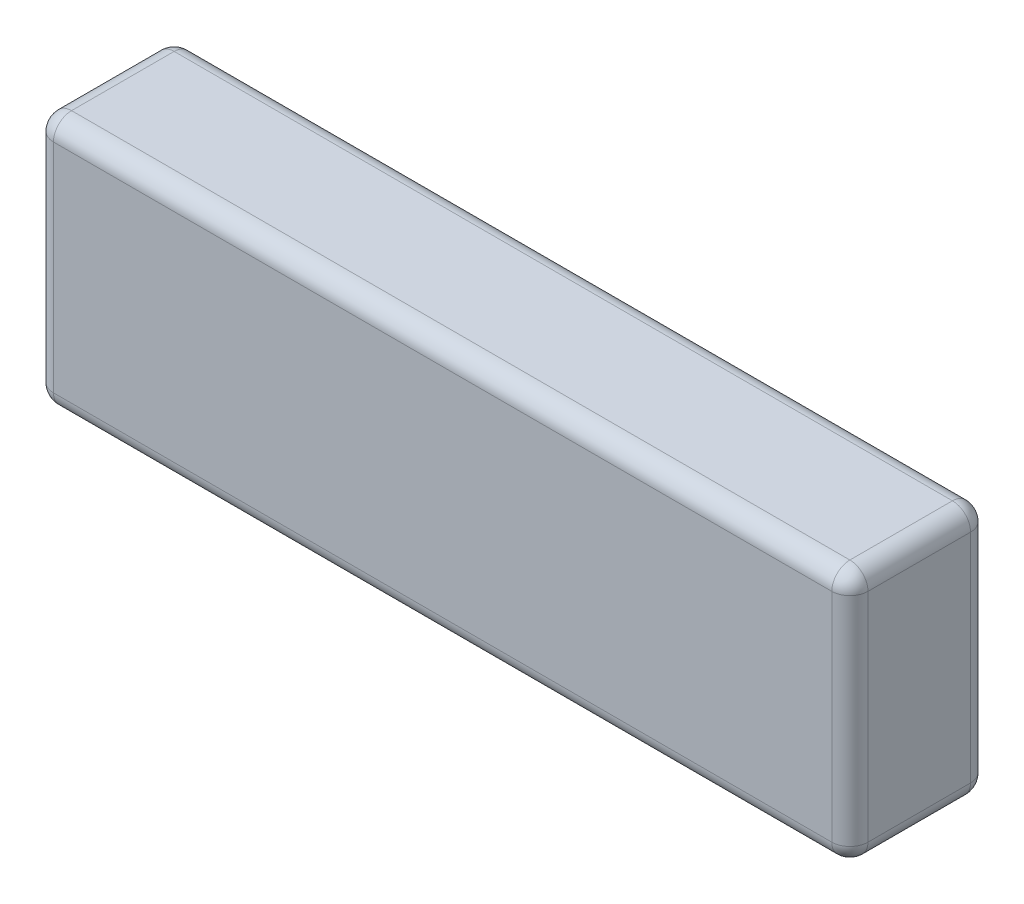
ISO-10303-21;
HEADER;
FILE_DESCRIPTION(('STEP AP214'),'2;1');
FILE_NAME('part.step','',(''),(''),'','','');
FILE_SCHEMA(('AUTOMOTIVE_DESIGN { 1 0 10303 214 1 1 1 1 }'));
ENDSEC;
DATA;
#1=APPLICATION_CONTEXT('core data for automotive mechanical design processes');
#2=APPLICATION_PROTOCOL_DEFINITION('international standard','automotive_design',2000,#1);
#3=PRODUCT_CONTEXT('',#1,'mechanical');
#4=PRODUCT('Part','Part','',(#3));
#5=PRODUCT_RELATED_PRODUCT_CATEGORY('part','',(#4));
#6=PRODUCT_DEFINITION_FORMATION('','',#4);
#7=PRODUCT_DEFINITION_CONTEXT('part definition',#1,'design');
#8=PRODUCT_DEFINITION('design','',#6,#7);
#9=PRODUCT_DEFINITION_SHAPE('','',#8);
#10=(LENGTH_UNIT() NAMED_UNIT(*) SI_UNIT(.MILLI.,.METRE.));
#11=(NAMED_UNIT(*) PLANE_ANGLE_UNIT() SI_UNIT($,.RADIAN.));
#12=(NAMED_UNIT(*) SI_UNIT($,.STERADIAN.) SOLID_ANGLE_UNIT());
#13=UNCERTAINTY_MEASURE_WITH_UNIT(LENGTH_MEASURE(1.E-05),#10,'distance_accuracy_value','');
#14=(GEOMETRIC_REPRESENTATION_CONTEXT(3) GLOBAL_UNCERTAINTY_ASSIGNED_CONTEXT((#13)) GLOBAL_UNIT_ASSIGNED_CONTEXT((#10,
#11,#12)) REPRESENTATION_CONTEXT('',''));
#15=CARTESIAN_POINT('',(0.,0.,0.));
#16=DIRECTION('',(0.,0.,1.));
#17=DIRECTION('',(1.,0.,0.));
#18=AXIS2_PLACEMENT_3D('',#15,#16,#17);
#19=CARTESIAN_POINT('',(67.5000000000001,-21.,11.5));
#20=DIRECTION('',(-1.,0.,0.));
#21=DIRECTION('',(0.,0.,1.));
#22=AXIS2_PLACEMENT_3D('',#19,#20,#21);
#23=PLANE('',#22);
#24=DIRECTION('',(0.,1.,0.));
#25=VECTOR('',#24,1.);
#26=CARTESIAN_POINT('',(67.5000000000001,21.,-8.5));
#27=LINE('',#26,#25);
#28=CARTESIAN_POINT('',(67.5000000000001,-18.,-8.5));
#29=VERTEX_POINT('',#28);
#30=CARTESIAN_POINT('',(67.5000000000001,18.,-8.5));
#31=VERTEX_POINT('',#30);
#32=EDGE_CURVE('E166',#29,#31,#27,.T.);
#33=ORIENTED_EDGE('',*,*,#32,.T.);
#34=DIRECTION('',(0.,0.,-1.));
#35=VECTOR('',#34,1.);
#36=CARTESIAN_POINT('',(67.5000000000001,18.,11.5));
#37=LINE('',#36,#35);
#38=CARTESIAN_POINT('',(67.5000000000001,18.,8.5));
#39=VERTEX_POINT('',#38);
#40=EDGE_CURVE('E168',#31,#39,#37,.F.);
#41=ORIENTED_EDGE('',*,*,#40,.T.);
#42=DIRECTION('',(0.,1.,0.));
#43=VECTOR('',#42,1.);
#44=CARTESIAN_POINT('',(67.5000000000001,-21.,8.5));
#45=LINE('',#44,#43);
#46=CARTESIAN_POINT('',(67.5000000000001,-18.,8.5));
#47=VERTEX_POINT('',#46);
#48=EDGE_CURVE('E162',#39,#47,#45,.F.);
#49=ORIENTED_EDGE('',*,*,#48,.T.);
#50=DIRECTION('',(0.,0.,-1.));
#51=VECTOR('',#50,1.);
#52=CARTESIAN_POINT('',(67.5000000000001,-18.,11.5));
#53=LINE('',#52,#51);
#54=EDGE_CURVE('E164',#47,#29,#53,.T.);
#55=ORIENTED_EDGE('',*,*,#54,.T.);
#56=EDGE_LOOP('',(#33,#41,#49,#55));
#57=FACE_BOUND('',#56,.T.);
#58=ADVANCED_FACE('F37',(#57),#23,.F.);
#59=CARTESIAN_POINT('',(-67.4999999999999,21.,11.5));
#60=DIRECTION('',(0.,-1.,0.));
#61=DIRECTION('',(0.,0.,-1.));
#62=AXIS2_PLACEMENT_3D('',#59,#60,#61);
#63=PLANE('',#62);
#64=DIRECTION('',(0.,0.,-1.));
#65=VECTOR('',#64,1.);
#66=CARTESIAN_POINT('',(64.5000000000001,21.,11.5));
#67=LINE('',#66,#65);
#68=CARTESIAN_POINT('',(64.5000000000001,21.,8.5));
#69=VERTEX_POINT('',#68);
#70=CARTESIAN_POINT('',(64.5000000000001,21.,-8.5));
#71=VERTEX_POINT('',#70);
#72=EDGE_CURVE('E139',#69,#71,#67,.T.);
#73=ORIENTED_EDGE('',*,*,#72,.T.);
#74=DIRECTION('',(-1.,0.,0.));
#75=VECTOR('',#74,1.);
#76=CARTESIAN_POINT('',(-67.4999999999999,21.,-8.5));
#77=LINE('',#76,#75);
#78=CARTESIAN_POINT('',(-64.4999999999999,21.,-8.5));
#79=VERTEX_POINT('',#78);
#80=EDGE_CURVE('E135',#71,#79,#77,.T.);
#81=ORIENTED_EDGE('',*,*,#80,.T.);
#82=DIRECTION('',(0.,0.,-1.));
#83=VECTOR('',#82,1.);
#84=CARTESIAN_POINT('',(-64.4999999999999,21.,11.5));
#85=LINE('',#84,#83);
#86=CARTESIAN_POINT('',(-64.4999999999999,21.,8.5));
#87=VERTEX_POINT('',#86);
#88=EDGE_CURVE('E128',#79,#87,#85,.F.);
#89=ORIENTED_EDGE('',*,*,#88,.T.);
#90=DIRECTION('',(-1.,0.,0.));
#91=VECTOR('',#90,1.);
#92=CARTESIAN_POINT('',(-67.4999999999999,21.,8.5));
#93=LINE('',#92,#91);
#94=EDGE_CURVE('E132',#87,#69,#93,.F.);
#95=ORIENTED_EDGE('',*,*,#94,.T.);
#96=EDGE_LOOP('',(#73,#81,#89,#95));
#97=FACE_BOUND('',#96,.T.);
#98=ADVANCED_FACE('F130',(#97),#63,.F.);
#99=CARTESIAN_POINT('',(-67.4999999999999,-21.,11.5));
#100=DIRECTION('',(1.,0.,0.));
#101=DIRECTION('',(0.,0.,-1.));
#102=AXIS2_PLACEMENT_3D('',#99,#100,#101);
#103=PLANE('',#102);
#104=DIRECTION('',(0.,0.,-1.));
#105=VECTOR('',#104,1.);
#106=CARTESIAN_POINT('',(-67.4999999999999,-18.,11.5));
#107=LINE('',#106,#105);
#108=CARTESIAN_POINT('',(-67.4999999999999,-18.,-8.5));
#109=VERTEX_POINT('',#108);
#110=CARTESIAN_POINT('',(-67.4999999999999,-18.,8.5));
#111=VERTEX_POINT('',#110);
#112=EDGE_CURVE('E198',#109,#111,#107,.F.);
#113=ORIENTED_EDGE('',*,*,#112,.T.);
#114=DIRECTION('',(0.,-1.,0.));
#115=VECTOR('',#114,1.);
#116=CARTESIAN_POINT('',(-67.4999999999999,-21.,8.5));
#117=LINE('',#116,#115);
#118=CARTESIAN_POINT('',(-67.4999999999999,18.,8.5));
#119=VERTEX_POINT('',#118);
#120=EDGE_CURVE('E11',#111,#119,#117,.F.);
#121=ORIENTED_EDGE('',*,*,#120,.T.);
#122=DIRECTION('',(0.,0.,-1.));
#123=VECTOR('',#122,1.);
#124=CARTESIAN_POINT('',(-67.4999999999999,18.,11.5));
#125=LINE('',#124,#123);
#126=CARTESIAN_POINT('',(-67.4999999999999,18.,-8.5));
#127=VERTEX_POINT('',#126);
#128=EDGE_CURVE('E46',#119,#127,#125,.T.);
#129=ORIENTED_EDGE('',*,*,#128,.T.);
#130=DIRECTION('',(0.,-1.,0.));
#131=VECTOR('',#130,1.);
#132=CARTESIAN_POINT('',(-67.4999999999999,-21.,-8.5));
#133=LINE('',#132,#131);
#134=EDGE_CURVE('E200',#127,#109,#133,.T.);
#135=ORIENTED_EDGE('',*,*,#134,.T.);
#136=EDGE_LOOP('',(#113,#121,#129,#135));
#137=FACE_BOUND('',#136,.T.);
#138=ADVANCED_FACE('F298',(#137),#103,.F.);
#139=CARTESIAN_POINT('',(-67.4999999999999,-21.,11.5));
#140=DIRECTION('',(0.,1.,0.));
#141=DIRECTION('',(0.,0.,1.));
#142=AXIS2_PLACEMENT_3D('',#139,#140,#141);
#143=PLANE('',#142);
#144=DIRECTION('',(0.,0.,-1.));
#145=VECTOR('',#144,1.);
#146=CARTESIAN_POINT('',(-64.4999999999999,-21.,11.5));
#147=LINE('',#146,#145);
#148=CARTESIAN_POINT('',(-64.4999999999999,-21.,8.5));
#149=VERTEX_POINT('',#148);
#150=CARTESIAN_POINT('',(-64.4999999999999,-21.,-8.5));
#151=VERTEX_POINT('',#150);
#152=EDGE_CURVE('E182',#149,#151,#147,.T.);
#153=ORIENTED_EDGE('',*,*,#152,.T.);
#154=DIRECTION('',(1.,0.,0.));
#155=VECTOR('',#154,1.);
#156=CARTESIAN_POINT('',(67.5000000000001,-21.,-8.5));
#157=LINE('',#156,#155);
#158=CARTESIAN_POINT('',(64.5000000000001,-21.,-8.5));
#159=VERTEX_POINT('',#158);
#160=EDGE_CURVE('E187',#151,#159,#157,.T.);
#161=ORIENTED_EDGE('',*,*,#160,.T.);
#162=DIRECTION('',(0.,0.,-1.));
#163=VECTOR('',#162,1.);
#164=CARTESIAN_POINT('',(64.5000000000001,-21.,11.5));
#165=LINE('',#164,#163);
#166=CARTESIAN_POINT('',(64.5000000000001,-21.,8.5));
#167=VERTEX_POINT('',#166);
#168=EDGE_CURVE('E184',#159,#167,#165,.F.);
#169=ORIENTED_EDGE('',*,*,#168,.T.);
#170=DIRECTION('',(1.,0.,0.));
#171=VECTOR('',#170,1.);
#172=CARTESIAN_POINT('',(-67.4999999999999,-21.,8.5));
#173=LINE('',#172,#171);
#174=EDGE_CURVE('E180',#167,#149,#173,.F.);
#175=ORIENTED_EDGE('',*,*,#174,.T.);
#176=EDGE_LOOP('',(#153,#161,#169,#175));
#177=FACE_BOUND('',#176,.T.);
#178=ADVANCED_FACE('F275',(#177),#143,.F.);
#179=CARTESIAN_POINT('',(0.,0.,11.5));
#180=DIRECTION('',(0.,0.,-1.));
#181=DIRECTION('',(-1.,0.,0.));
#182=AXIS2_PLACEMENT_3D('',#179,#180,#181);
#183=PLANE('',#182);
#184=DIRECTION('',(0.,-1.,0.));
#185=VECTOR('',#184,1.);
#186=CARTESIAN_POINT('',(-64.4999999999999,0.,11.5));
#187=LINE('',#186,#185);
#188=CARTESIAN_POINT('',(-64.4999999999999,18.,11.5));
#189=VERTEX_POINT('',#188);
#190=CARTESIAN_POINT('',(-64.4999999999999,-18.,11.5));
#191=VERTEX_POINT('',#190);
#192=EDGE_CURVE('E191',#189,#191,#187,.T.);
#193=ORIENTED_EDGE('',*,*,#192,.T.);
#194=DIRECTION('',(1.,0.,0.));
#195=VECTOR('',#194,1.);
#196=CARTESIAN_POINT('',(0.,-18.,11.5));
#197=LINE('',#196,#195);
#198=CARTESIAN_POINT('',(64.5000000000001,-18.,11.5));
#199=VERTEX_POINT('',#198);
#200=EDGE_CURVE('E196',#191,#199,#197,.T.);
#201=ORIENTED_EDGE('',*,*,#200,.T.);
#202=DIRECTION('',(0.,1.,0.));
#203=VECTOR('',#202,1.);
#204=CARTESIAN_POINT('',(64.5000000000001,0.,11.5));
#205=LINE('',#204,#203);
#206=CARTESIAN_POINT('',(64.5000000000001,18.,11.5));
#207=VERTEX_POINT('',#206);
#208=EDGE_CURVE('E193',#199,#207,#205,.T.);
#209=ORIENTED_EDGE('',*,*,#208,.T.);
#210=DIRECTION('',(-1.,0.,0.));
#211=VECTOR('',#210,1.);
#212=CARTESIAN_POINT('',(0.,18.,11.5));
#213=LINE('',#212,#211);
#214=EDGE_CURVE('E189',#207,#189,#213,.T.);
#215=ORIENTED_EDGE('',*,*,#214,.T.);
#216=EDGE_LOOP('',(#193,#201,#209,#215));
#217=FACE_BOUND('',#216,.T.);
#218=ADVANCED_FACE('F305',(#217),#183,.F.);
#219=CARTESIAN_POINT('',(0.,0.,-11.5));
#220=DIRECTION('',(0.,0.,-1.));
#221=DIRECTION('',(-1.,0.,0.));
#222=AXIS2_PLACEMENT_3D('',#219,#220,#221);
#223=PLANE('',#222);
#224=DIRECTION('',(0.,1.,0.));
#225=VECTOR('',#224,1.);
#226=CARTESIAN_POINT('',(64.5000000000001,-21.,-11.5));
#227=LINE('',#226,#225);
#228=CARTESIAN_POINT('',(64.5000000000001,18.,-11.5));
#229=VERTEX_POINT('',#228);
#230=CARTESIAN_POINT('',(64.5000000000001,-18.,-11.5));
#231=VERTEX_POINT('',#230);
#232=EDGE_CURVE('E175',#229,#231,#227,.F.);
#233=ORIENTED_EDGE('',*,*,#232,.T.);
#234=DIRECTION('',(1.,0.,0.));
#235=VECTOR('',#234,1.);
#236=CARTESIAN_POINT('',(-67.4999999999999,-18.,-11.5));
#237=LINE('',#236,#235);
#238=CARTESIAN_POINT('',(-64.4999999999999,-18.,-11.5));
#239=VERTEX_POINT('',#238);
#240=EDGE_CURVE('E178',#231,#239,#237,.F.);
#241=ORIENTED_EDGE('',*,*,#240,.T.);
#242=DIRECTION('',(0.,-1.,0.));
#243=VECTOR('',#242,1.);
#244=CARTESIAN_POINT('',(-64.4999999999999,21.,-11.5));
#245=LINE('',#244,#243);
#246=CARTESIAN_POINT('',(-64.4999999999999,18.,-11.5));
#247=VERTEX_POINT('',#246);
#248=EDGE_CURVE('E173',#239,#247,#245,.F.);
#249=ORIENTED_EDGE('',*,*,#248,.T.);
#250=DIRECTION('',(-1.,0.,0.));
#251=VECTOR('',#250,1.);
#252=CARTESIAN_POINT('',(67.5000000000001,18.,-11.5));
#253=LINE('',#252,#251);
#254=EDGE_CURVE('E171',#247,#229,#253,.F.);
#255=ORIENTED_EDGE('',*,*,#254,.T.);
#256=EDGE_LOOP('',(#233,#241,#249,#255));
#257=FACE_BOUND('',#256,.T.);
#258=ADVANCED_FACE('F266',(#257),#223,.T.);
#259=CARTESIAN_POINT('',(-64.4999999999999,-18.,11.5));
#260=DIRECTION('',(0.,0.,-1.));
#261=DIRECTION('',(-1.,0.,0.));
#262=AXIS2_PLACEMENT_3D('',#259,#260,#261);
#263=CYLINDRICAL_SURFACE('',#262,3.);
#264=CARTESIAN_POINT('',(-64.4999999999999,-18.,8.5));
#265=DIRECTION('',(0.,0.,1.));
#266=DIRECTION('',(1.,0.,0.));
#267=AXIS2_PLACEMENT_3D('',#264,#265,#266);
#268=CIRCLE('',#267,3.);
#269=EDGE_CURVE('E41',#111,#149,#268,.T.);
#270=ORIENTED_EDGE('',*,*,#269,.F.);
#271=ORIENTED_EDGE('',*,*,#112,.F.);
#272=CARTESIAN_POINT('',(-64.4999999999999,-18.,-8.5));
#273=DIRECTION('',(0.,0.,-1.));
#274=DIRECTION('',(-1.,0.,0.));
#275=AXIS2_PLACEMENT_3D('',#272,#273,#274);
#276=CIRCLE('',#275,3.);
#277=EDGE_CURVE('E158',#151,#109,#276,.T.);
#278=ORIENTED_EDGE('',*,*,#277,.F.);
#279=ORIENTED_EDGE('',*,*,#152,.F.);
#280=EDGE_LOOP('',(#270,#271,#278,#279));
#281=FACE_BOUND('',#280,.T.);
#282=ADVANCED_FACE('F39',(#281),#263,.T.);
#283=CARTESIAN_POINT('',(-64.4999999999999,-18.,8.5));
#284=DIRECTION('',(0.,0.,1.));
#285=DIRECTION('',(1.,0.,0.));
#286=AXIS2_PLACEMENT_3D('',#283,#284,#285);
#287=SPHERICAL_SURFACE('',#286,3.);
#288=CARTESIAN_POINT('',(-64.4999999999999,-18.,8.5));
#289=DIRECTION('',(0.,-1.,0.));
#290=DIRECTION('',(0.,0.,-1.));
#291=AXIS2_PLACEMENT_3D('',#288,#289,#290);
#292=CIRCLE('',#291,3.);
#293=EDGE_CURVE('E245',#111,#191,#292,.F.);
#294=ORIENTED_EDGE('',*,*,#293,.F.);
#295=ORIENTED_EDGE('',*,*,#269,.T.);
#296=CARTESIAN_POINT('',(-64.4999999999999,-18.,8.5));
#297=DIRECTION('',(-1.,0.,0.));
#298=DIRECTION('',(0.,0.,1.));
#299=AXIS2_PLACEMENT_3D('',#296,#297,#298);
#300=CIRCLE('',#299,3.);
#301=EDGE_CURVE('E248',#191,#149,#300,.F.);
#302=ORIENTED_EDGE('',*,*,#301,.F.);
#303=EDGE_LOOP('',(#294,#295,#302));
#304=FACE_BOUND('',#303,.T.);
#305=ADVANCED_FACE('F293',(#304),#287,.T.);
#306=CARTESIAN_POINT('',(-64.4999999999999,-18.,-8.5));
#307=DIRECTION('',(0.,0.,1.));
#308=DIRECTION('',(1.,0.,0.));
#309=AXIS2_PLACEMENT_3D('',#306,#307,#308);
#310=SPHERICAL_SURFACE('',#309,3.);
#311=CARTESIAN_POINT('',(-64.4999999999999,-18.,-8.5));
#312=DIRECTION('',(-1.,0.,0.));
#313=DIRECTION('',(0.,0.,1.));
#314=AXIS2_PLACEMENT_3D('',#311,#312,#313);
#315=CIRCLE('',#314,3.);
#316=EDGE_CURVE('E239',#151,#239,#315,.F.);
#317=ORIENTED_EDGE('',*,*,#316,.F.);
#318=ORIENTED_EDGE('',*,*,#277,.T.);
#319=CARTESIAN_POINT('',(-64.4999999999999,-18.,-8.5));
#320=DIRECTION('',(0.,-1.,0.));
#321=DIRECTION('',(0.,0.,-1.));
#322=AXIS2_PLACEMENT_3D('',#319,#320,#321);
#323=CIRCLE('',#322,3.);
#324=EDGE_CURVE('E242',#239,#109,#323,.F.);
#325=ORIENTED_EDGE('',*,*,#324,.F.);
#326=EDGE_LOOP('',(#317,#318,#325));
#327=FACE_BOUND('',#326,.T.);
#328=ADVANCED_FACE('F255',(#327),#310,.T.);
#329=CARTESIAN_POINT('',(0.,-18.,8.5));
#330=DIRECTION('',(1.,0.,0.));
#331=DIRECTION('',(0.,0.,-1.));
#332=AXIS2_PLACEMENT_3D('',#329,#330,#331);
#333=CYLINDRICAL_SURFACE('',#332,3.);
#334=ORIENTED_EDGE('',*,*,#301,.T.);
#335=ORIENTED_EDGE('',*,*,#174,.F.);
#336=CARTESIAN_POINT('',(64.5000000000001,-18.,8.5));
#337=DIRECTION('',(1.,0.,0.));
#338=DIRECTION('',(0.,0.,-1.));
#339=AXIS2_PLACEMENT_3D('',#336,#337,#338);
#340=CIRCLE('',#339,3.);
#341=EDGE_CURVE('E234',#199,#167,#340,.T.);
#342=ORIENTED_EDGE('',*,*,#341,.F.);
#343=ORIENTED_EDGE('',*,*,#200,.F.);
#344=EDGE_LOOP('',(#334,#335,#342,#343));
#345=FACE_BOUND('',#344,.T.);
#346=ADVANCED_FACE('F287',(#345),#333,.T.);
#347=CARTESIAN_POINT('',(-64.4999999999999,0.,8.5));
#348=DIRECTION('',(0.,-1.,0.));
#349=DIRECTION('',(0.,0.,-1.));
#350=AXIS2_PLACEMENT_3D('',#347,#348,#349);
#351=CYLINDRICAL_SURFACE('',#350,3.);
#352=ORIENTED_EDGE('',*,*,#293,.T.);
#353=ORIENTED_EDGE('',*,*,#192,.F.);
#354=CARTESIAN_POINT('',(-64.4999999999999,18.,8.5));
#355=DIRECTION('',(0.,1.,0.));
#356=DIRECTION('',(0.,0.,1.));
#357=AXIS2_PLACEMENT_3D('',#354,#355,#356);
#358=CIRCLE('',#357,3.);
#359=EDGE_CURVE('E142',#119,#189,#358,.T.);
#360=ORIENTED_EDGE('',*,*,#359,.F.);
#361=ORIENTED_EDGE('',*,*,#120,.F.);
#362=EDGE_LOOP('',(#352,#353,#360,#361));
#363=FACE_BOUND('',#362,.T.);
#364=ADVANCED_FACE('F297',(#363),#351,.T.);
#365=CARTESIAN_POINT('',(-64.4999999999999,18.,11.5));
#366=DIRECTION('',(0.,0.,-1.));
#367=DIRECTION('',(-1.,0.,0.));
#368=AXIS2_PLACEMENT_3D('',#365,#366,#367);
#369=CYLINDRICAL_SURFACE('',#368,3.);
#370=CARTESIAN_POINT('',(-64.4999999999999,18.,-8.5));
#371=DIRECTION('',(0.,0.,-1.));
#372=DIRECTION('',(-1.,0.,0.));
#373=AXIS2_PLACEMENT_3D('',#370,#371,#372);
#374=CIRCLE('',#373,3.);
#375=EDGE_CURVE('E143',#127,#79,#374,.T.);
#376=ORIENTED_EDGE('',*,*,#375,.F.);
#377=ORIENTED_EDGE('',*,*,#128,.F.);
#378=CARTESIAN_POINT('',(-64.4999999999999,18.,8.5));
#379=DIRECTION('',(0.,0.,1.));
#380=DIRECTION('',(1.,0.,0.));
#381=AXIS2_PLACEMENT_3D('',#378,#379,#380);
#382=CIRCLE('',#381,3.);
#383=EDGE_CURVE('E54',#87,#119,#382,.T.);
#384=ORIENTED_EDGE('',*,*,#383,.F.);
#385=ORIENTED_EDGE('',*,*,#88,.F.);
#386=EDGE_LOOP('',(#376,#377,#384,#385));
#387=FACE_BOUND('',#386,.T.);
#388=ADVANCED_FACE('F141',(#387),#369,.T.);
#389=CARTESIAN_POINT('',(-64.4999999999999,-21.,-8.5));
#390=DIRECTION('',(0.,1.,0.));
#391=DIRECTION('',(0.,0.,1.));
#392=AXIS2_PLACEMENT_3D('',#389,#390,#391);
#393=CYLINDRICAL_SURFACE('',#392,3.);
#394=ORIENTED_EDGE('',*,*,#324,.T.);
#395=ORIENTED_EDGE('',*,*,#134,.F.);
#396=CARTESIAN_POINT('',(-64.4999999999999,18.,-8.5));
#397=DIRECTION('',(0.,1.,0.));
#398=DIRECTION('',(-1.,0.,0.));
#399=AXIS2_PLACEMENT_3D('',#396,#397,#398);
#400=CIRCLE('',#399,3.);
#401=EDGE_CURVE('E229',#247,#127,#400,.T.);
#402=ORIENTED_EDGE('',*,*,#401,.F.);
#403=ORIENTED_EDGE('',*,*,#248,.F.);
#404=EDGE_LOOP('',(#394,#395,#402,#403));
#405=FACE_BOUND('',#404,.T.);
#406=ADVANCED_FACE('F262',(#405),#393,.T.);
#407=CARTESIAN_POINT('',(-67.4999999999999,-18.,-8.5));
#408=DIRECTION('',(-1.,0.,0.));
#409=DIRECTION('',(0.,0.,1.));
#410=AXIS2_PLACEMENT_3D('',#407,#408,#409);
#411=CYLINDRICAL_SURFACE('',#410,3.);
#412=ORIENTED_EDGE('',*,*,#316,.T.);
#413=ORIENTED_EDGE('',*,*,#240,.F.);
#414=CARTESIAN_POINT('',(64.5000000000001,-18.,-8.5));
#415=DIRECTION('',(1.,0.,0.));
#416=DIRECTION('',(0.,0.,-1.));
#417=AXIS2_PLACEMENT_3D('',#414,#415,#416);
#418=CIRCLE('',#417,3.);
#419=EDGE_CURVE('E226',#159,#231,#418,.T.);
#420=ORIENTED_EDGE('',*,*,#419,.F.);
#421=ORIENTED_EDGE('',*,*,#160,.F.);
#422=EDGE_LOOP('',(#412,#413,#420,#421));
#423=FACE_BOUND('',#422,.T.);
#424=ADVANCED_FACE('F272',(#423),#411,.T.);
#425=CARTESIAN_POINT('',(64.5000000000001,-18.,11.5));
#426=DIRECTION('',(0.,0.,-1.));
#427=DIRECTION('',(-1.,0.,0.));
#428=AXIS2_PLACEMENT_3D('',#425,#426,#427);
#429=CYLINDRICAL_SURFACE('',#428,3.);
#430=CARTESIAN_POINT('',(64.5000000000001,-18.,8.5));
#431=DIRECTION('',(0.,0.,1.));
#432=DIRECTION('',(1.,0.,0.));
#433=AXIS2_PLACEMENT_3D('',#430,#431,#432);
#434=CIRCLE('',#433,3.);
#435=EDGE_CURVE('E236',#167,#47,#434,.T.);
#436=ORIENTED_EDGE('',*,*,#435,.F.);
#437=ORIENTED_EDGE('',*,*,#168,.F.);
#438=CARTESIAN_POINT('',(64.5000000000001,-18.,-8.5));
#439=DIRECTION('',(0.,0.,-1.));
#440=DIRECTION('',(-1.,0.,0.));
#441=AXIS2_PLACEMENT_3D('',#438,#439,#440);
#442=CIRCLE('',#441,3.);
#443=EDGE_CURVE('E223',#29,#159,#442,.T.);
#444=ORIENTED_EDGE('',*,*,#443,.F.);
#445=ORIENTED_EDGE('',*,*,#54,.F.);
#446=EDGE_LOOP('',(#436,#437,#444,#445));
#447=FACE_BOUND('',#446,.T.);
#448=ADVANCED_FACE('F279',(#447),#429,.T.);
#449=CARTESIAN_POINT('',(64.5000000000001,-18.,8.5));
#450=DIRECTION('',(0.,0.,1.));
#451=DIRECTION('',(1.,0.,0.));
#452=AXIS2_PLACEMENT_3D('',#449,#450,#451);
#453=SPHERICAL_SURFACE('',#452,3.);
#454=ORIENTED_EDGE('',*,*,#341,.T.);
#455=ORIENTED_EDGE('',*,*,#435,.T.);
#456=CARTESIAN_POINT('',(64.5000000000001,-18.,8.5));
#457=DIRECTION('',(0.,-1.,0.));
#458=DIRECTION('',(0.,0.,-1.));
#459=AXIS2_PLACEMENT_3D('',#456,#457,#458);
#460=CIRCLE('',#459,3.);
#461=EDGE_CURVE('E150',#199,#47,#460,.F.);
#462=ORIENTED_EDGE('',*,*,#461,.F.);
#463=EDGE_LOOP('',(#454,#455,#462));
#464=FACE_BOUND('',#463,.T.);
#465=ADVANCED_FACE('F350',(#464),#453,.T.);
#466=CARTESIAN_POINT('',(-64.4999999999999,18.,8.5));
#467=DIRECTION('',(0.,0.,1.));
#468=DIRECTION('',(1.,0.,0.));
#469=AXIS2_PLACEMENT_3D('',#466,#467,#468);
#470=SPHERICAL_SURFACE('',#469,3.);
#471=ORIENTED_EDGE('',*,*,#383,.T.);
#472=ORIENTED_EDGE('',*,*,#359,.T.);
#473=CARTESIAN_POINT('',(-64.4999999999999,18.,8.5));
#474=DIRECTION('',(-1.,0.,0.));
#475=DIRECTION('',(0.,0.,1.));
#476=AXIS2_PLACEMENT_3D('',#473,#474,#475);
#477=CIRCLE('',#476,3.);
#478=EDGE_CURVE('E146',#87,#189,#477,.F.);
#479=ORIENTED_EDGE('',*,*,#478,.F.);
#480=EDGE_LOOP('',(#471,#472,#479));
#481=FACE_BOUND('',#480,.T.);
#482=ADVANCED_FACE('F147',(#481),#470,.T.);
#483=CARTESIAN_POINT('',(-64.4999999999999,18.,-8.5));
#484=DIRECTION('',(0.,0.,1.));
#485=DIRECTION('',(1.,0.,0.));
#486=AXIS2_PLACEMENT_3D('',#483,#484,#485);
#487=SPHERICAL_SURFACE('',#486,3.);
#488=ORIENTED_EDGE('',*,*,#401,.T.);
#489=ORIENTED_EDGE('',*,*,#375,.T.);
#490=CARTESIAN_POINT('',(-64.4999999999999,18.,-8.5));
#491=DIRECTION('',(-1.,0.,0.));
#492=DIRECTION('',(0.,0.,1.));
#493=AXIS2_PLACEMENT_3D('',#490,#491,#492);
#494=CIRCLE('',#493,3.);
#495=EDGE_CURVE('E151',#247,#79,#494,.F.);
#496=ORIENTED_EDGE('',*,*,#495,.F.);
#497=EDGE_LOOP('',(#488,#489,#496));
#498=FACE_BOUND('',#497,.T.);
#499=ADVANCED_FACE('F343',(#498),#487,.T.);
#500=CARTESIAN_POINT('',(64.5000000000001,-18.,-8.5));
#501=DIRECTION('',(0.,0.,1.));
#502=DIRECTION('',(1.,0.,0.));
#503=AXIS2_PLACEMENT_3D('',#500,#501,#502);
#504=SPHERICAL_SURFACE('',#503,3.);
#505=ORIENTED_EDGE('',*,*,#443,.T.);
#506=ORIENTED_EDGE('',*,*,#419,.T.);
#507=CARTESIAN_POINT('',(64.5000000000001,-18.,-8.5));
#508=DIRECTION('',(0.,-1.,0.));
#509=DIRECTION('',(0.,0.,-1.));
#510=AXIS2_PLACEMENT_3D('',#507,#508,#509);
#511=CIRCLE('',#510,3.);
#512=EDGE_CURVE('E217',#29,#231,#511,.F.);
#513=ORIENTED_EDGE('',*,*,#512,.F.);
#514=EDGE_LOOP('',(#505,#506,#513));
#515=FACE_BOUND('',#514,.T.);
#516=ADVANCED_FACE('F339',(#515),#504,.T.);
#517=CARTESIAN_POINT('',(64.5000000000001,0.,8.5));
#518=DIRECTION('',(0.,1.,0.));
#519=DIRECTION('',(0.,0.,1.));
#520=AXIS2_PLACEMENT_3D('',#517,#518,#519);
#521=CYLINDRICAL_SURFACE('',#520,3.);
#522=ORIENTED_EDGE('',*,*,#461,.T.);
#523=ORIENTED_EDGE('',*,*,#48,.F.);
#524=CARTESIAN_POINT('',(64.5000000000001,18.,8.5));
#525=DIRECTION('',(0.,1.,0.));
#526=DIRECTION('',(0.,0.,1.));
#527=AXIS2_PLACEMENT_3D('',#524,#525,#526);
#528=CIRCLE('',#527,3.);
#529=EDGE_CURVE('E214',#207,#39,#528,.T.);
#530=ORIENTED_EDGE('',*,*,#529,.F.);
#531=ORIENTED_EDGE('',*,*,#208,.F.);
#532=EDGE_LOOP('',(#522,#523,#530,#531));
#533=FACE_BOUND('',#532,.T.);
#534=ADVANCED_FACE('F336',(#533),#521,.T.);
#535=CARTESIAN_POINT('',(0.,18.,8.5));
#536=DIRECTION('',(-1.,0.,0.));
#537=DIRECTION('',(0.,0.,1.));
#538=AXIS2_PLACEMENT_3D('',#535,#536,#537);
#539=CYLINDRICAL_SURFACE('',#538,3.);
#540=ORIENTED_EDGE('',*,*,#478,.T.);
#541=ORIENTED_EDGE('',*,*,#214,.F.);
#542=CARTESIAN_POINT('',(64.5000000000001,18.,8.5));
#543=DIRECTION('',(1.,0.,0.));
#544=DIRECTION('',(0.,0.,-1.));
#545=AXIS2_PLACEMENT_3D('',#542,#543,#544);
#546=CIRCLE('',#545,3.);
#547=EDGE_CURVE('E154',#69,#207,#546,.T.);
#548=ORIENTED_EDGE('',*,*,#547,.F.);
#549=ORIENTED_EDGE('',*,*,#94,.F.);
#550=EDGE_LOOP('',(#540,#541,#548,#549));
#551=FACE_BOUND('',#550,.T.);
#552=ADVANCED_FACE('F153',(#551),#539,.T.);
#553=CARTESIAN_POINT('',(-67.4999999999999,18.,-8.5));
#554=DIRECTION('',(1.,0.,0.));
#555=DIRECTION('',(0.,0.,-1.));
#556=AXIS2_PLACEMENT_3D('',#553,#554,#555);
#557=CYLINDRICAL_SURFACE('',#556,3.);
#558=ORIENTED_EDGE('',*,*,#495,.T.);
#559=ORIENTED_EDGE('',*,*,#80,.F.);
#560=CARTESIAN_POINT('',(64.5000000000001,18.,-8.5));
#561=DIRECTION('',(1.,0.,0.));
#562=DIRECTION('',(0.,0.,-1.));
#563=AXIS2_PLACEMENT_3D('',#560,#561,#562);
#564=CIRCLE('',#563,3.);
#565=EDGE_CURVE('E210',#229,#71,#564,.T.);
#566=ORIENTED_EDGE('',*,*,#565,.F.);
#567=ORIENTED_EDGE('',*,*,#254,.F.);
#568=EDGE_LOOP('',(#558,#559,#566,#567));
#569=FACE_BOUND('',#568,.T.);
#570=ADVANCED_FACE('F329',(#569),#557,.T.);
#571=CARTESIAN_POINT('',(64.5000000000001,-21.,-8.5));
#572=DIRECTION('',(0.,-1.,0.));
#573=DIRECTION('',(0.,0.,-1.));
#574=AXIS2_PLACEMENT_3D('',#571,#572,#573);
#575=CYLINDRICAL_SURFACE('',#574,3.);
#576=ORIENTED_EDGE('',*,*,#512,.T.);
#577=ORIENTED_EDGE('',*,*,#232,.F.);
#578=CARTESIAN_POINT('',(64.5000000000001,18.,-8.5));
#579=DIRECTION('',(0.,1.,0.));
#580=DIRECTION('',(0.,0.,1.));
#581=AXIS2_PLACEMENT_3D('',#578,#579,#580);
#582=CIRCLE('',#581,3.);
#583=EDGE_CURVE('E207',#31,#229,#582,.T.);
#584=ORIENTED_EDGE('',*,*,#583,.F.);
#585=ORIENTED_EDGE('',*,*,#32,.F.);
#586=EDGE_LOOP('',(#576,#577,#584,#585));
#587=FACE_BOUND('',#586,.T.);
#588=ADVANCED_FACE('F325',(#587),#575,.T.);
#589=CARTESIAN_POINT('',(64.5000000000001,18.,8.5));
#590=DIRECTION('',(0.,0.,1.));
#591=DIRECTION('',(1.,0.,0.));
#592=AXIS2_PLACEMENT_3D('',#589,#590,#591);
#593=SPHERICAL_SURFACE('',#592,3.);
#594=ORIENTED_EDGE('',*,*,#547,.T.);
#595=ORIENTED_EDGE('',*,*,#529,.T.);
#596=CARTESIAN_POINT('',(64.5000000000001,18.,8.5));
#597=DIRECTION('',(0.,0.,1.));
#598=DIRECTION('',(1.,0.,0.));
#599=AXIS2_PLACEMENT_3D('',#596,#597,#598);
#600=CIRCLE('',#599,3.);
#601=EDGE_CURVE('E205',#69,#39,#600,.F.);
#602=ORIENTED_EDGE('',*,*,#601,.F.);
#603=EDGE_LOOP('',(#594,#595,#602));
#604=FACE_BOUND('',#603,.T.);
#605=ADVANCED_FACE('F321',(#604),#593,.T.);
#606=CARTESIAN_POINT('',(64.5000000000001,18.,-8.5));
#607=DIRECTION('',(0.,0.,1.));
#608=DIRECTION('',(1.,0.,0.));
#609=AXIS2_PLACEMENT_3D('',#606,#607,#608);
#610=SPHERICAL_SURFACE('',#609,3.);
#611=ORIENTED_EDGE('',*,*,#583,.T.);
#612=ORIENTED_EDGE('',*,*,#565,.T.);
#613=CARTESIAN_POINT('',(64.5000000000001,18.,-8.5));
#614=DIRECTION('',(0.,0.,-1.));
#615=DIRECTION('',(-1.,0.,0.));
#616=AXIS2_PLACEMENT_3D('',#613,#614,#615);
#617=CIRCLE('',#616,3.);
#618=EDGE_CURVE('E203',#31,#71,#617,.F.);
#619=ORIENTED_EDGE('',*,*,#618,.F.);
#620=EDGE_LOOP('',(#611,#612,#619));
#621=FACE_BOUND('',#620,.T.);
#622=ADVANCED_FACE('F317',(#621),#610,.T.);
#623=CARTESIAN_POINT('',(64.5000000000001,18.,11.5));
#624=DIRECTION('',(0.,0.,-1.));
#625=DIRECTION('',(-1.,0.,0.));
#626=AXIS2_PLACEMENT_3D('',#623,#624,#625);
#627=CYLINDRICAL_SURFACE('',#626,3.);
#628=ORIENTED_EDGE('',*,*,#601,.T.);
#629=ORIENTED_EDGE('',*,*,#40,.F.);
#630=ORIENTED_EDGE('',*,*,#618,.T.);
#631=ORIENTED_EDGE('',*,*,#72,.F.);
#632=EDGE_LOOP('',(#628,#629,#630,#631));
#633=FACE_BOUND('',#632,.T.);
#634=ADVANCED_FACE('F314',(#633),#627,.T.);
#635=CLOSED_SHELL('',(#58,#98,#138,#178,#218,#258,#282,#305,#328,#346,#364,#388,#406,#424,#448,
#465,#482,#499,#516,#534,#552,#570,#588,#605,#622,#634));
#636=MANIFOLD_SOLID_BREP('B2',#635);
#637=ADVANCED_BREP_SHAPE_REPRESENTATION('',(#18,#636),#14);
#638=SHAPE_DEFINITION_REPRESENTATION(#9,#637);
ENDSEC;
END-ISO-10303-21;
